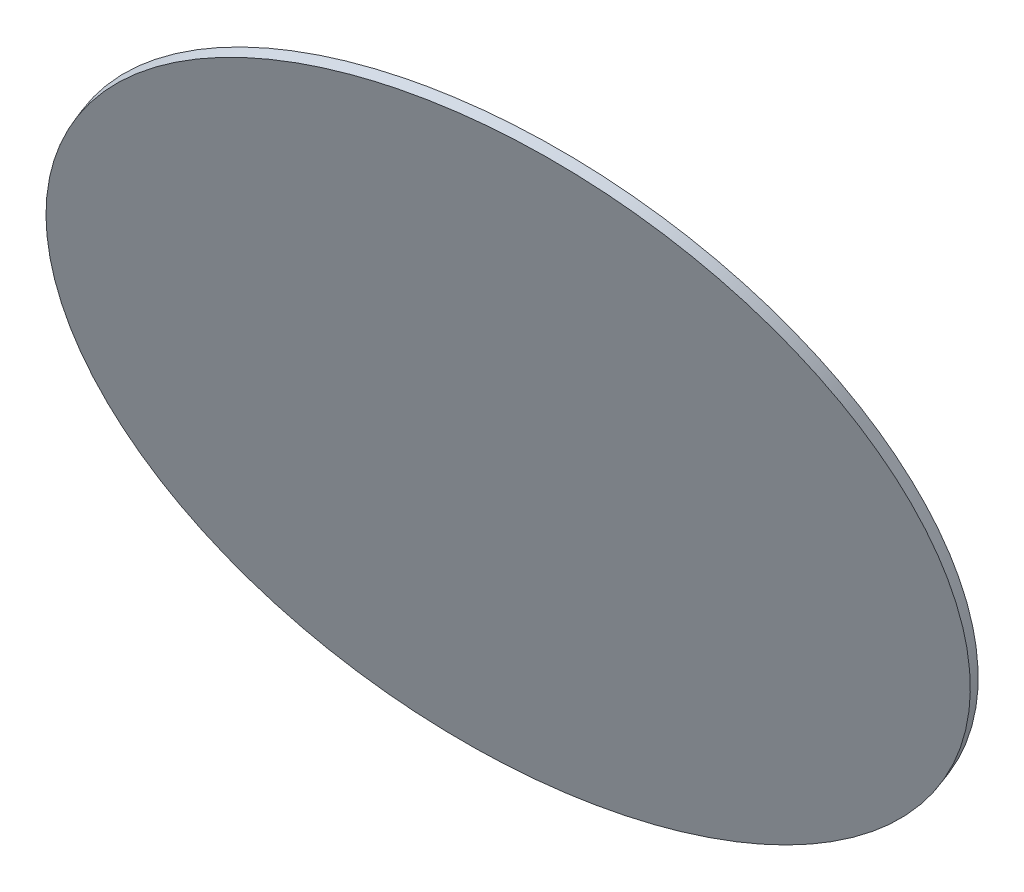
ISO-10303-21;
HEADER;
FILE_DESCRIPTION(('STEP AP214'),'2;1');
FILE_NAME('part.step','',(''),(''),'','','');
FILE_SCHEMA(('AUTOMOTIVE_DESIGN { 1 0 10303 214 1 1 1 1 }'));
ENDSEC;
DATA;
#1=APPLICATION_CONTEXT('core data for automotive mechanical design processes');
#2=APPLICATION_PROTOCOL_DEFINITION('international standard','automotive_design',2000,#1);
#3=PRODUCT_CONTEXT('',#1,'mechanical');
#4=PRODUCT('Part','Part','',(#3));
#5=PRODUCT_RELATED_PRODUCT_CATEGORY('part','',(#4));
#6=PRODUCT_DEFINITION_FORMATION('','',#4);
#7=PRODUCT_DEFINITION_CONTEXT('part definition',#1,'design');
#8=PRODUCT_DEFINITION('design','',#6,#7);
#9=PRODUCT_DEFINITION_SHAPE('','',#8);
#10=(LENGTH_UNIT() NAMED_UNIT(*) SI_UNIT(.MILLI.,.METRE.));
#11=(NAMED_UNIT(*) PLANE_ANGLE_UNIT() SI_UNIT($,.RADIAN.));
#12=(NAMED_UNIT(*) SI_UNIT($,.STERADIAN.) SOLID_ANGLE_UNIT());
#13=UNCERTAINTY_MEASURE_WITH_UNIT(LENGTH_MEASURE(1.E-05),#10,'distance_accuracy_value','');
#14=(GEOMETRIC_REPRESENTATION_CONTEXT(3) GLOBAL_UNCERTAINTY_ASSIGNED_CONTEXT((#13)) GLOBAL_UNIT_ASSIGNED_CONTEXT((#10,
#11,#12)) REPRESENTATION_CONTEXT('',''));
#15=CARTESIAN_POINT('',(0.,0.,0.));
#16=DIRECTION('',(0.,0.,1.));
#17=DIRECTION('',(1.,0.,0.));
#18=AXIS2_PLACEMENT_3D('',#15,#16,#17);
#19=CARTESIAN_POINT('',(-42.9029332590855,402.435326808663,-240.543266880281));
#20=CARTESIAN_POINT('',(-51.1638476256232,401.977621900581,-239.020083496684));
#21=CARTESIAN_POINT('',(-67.6856763586985,400.270607333418,-236.211587877307));
#22=CARTESIAN_POINT('',(-92.2297480946367,395.359930454819,-232.753028913838));
#23=CARTESIAN_POINT('',(-116.298775638929,388.146391051156,-230.081962229423));
#24=CARTESIAN_POINT('',(-139.660961098854,378.699459450207,-228.224111656387));
#25=CARTESIAN_POINT('',(-162.091313857364,367.110114767509,-227.197369311352));
#26=CARTESIAN_POINT('',(-183.373817355716,353.489968727735,-227.011623284376));
#27=CARTESIAN_POINT('',(-203.303509451021,337.970190782778,-227.668662411238));
#28=CARTESIAN_POINT('',(-221.688456313724,320.700244878221,-229.162159045971));
#29=CARTESIAN_POINT('',(-238.351600855302,301.846450033838,-231.477729999556));
#30=CARTESIAN_POINT('',(-253.132467884819,281.590378600513,-234.593075057888));
#31=CARTESIAN_POINT('',(-265.888709572736,260.127107619245,-238.478191745036));
#32=CARTESIAN_POINT('',(-276.497476338328,237.663340122599,-243.095664263481));
#33=CARTESIAN_POINT('',(-284.8565999583,214.415414471514,-248.401023828704));
#34=CARTESIAN_POINT('',(-290.885577502631,190.607220898617,-254.343176927887));
#35=CARTESIAN_POINT('',(-294.526346621793,166.468045322899,-260.864897378374));
#36=CARTESIAN_POINT('',(-295.743844718923,142.230361200969,-267.90337744709));
#37=CARTESIAN_POINT('',(-294.526346621793,118.127590680588,-275.390832723351));
#38=CARTESIAN_POINT('',(-290.885577502631,94.3918566177812,-283.255154919786));
#39=CARTESIAN_POINT('',(-284.8565999583,71.2517471068455,-291.420606314568));
#40=CARTESIAN_POINT('',(-276.497476338328,48.9301140520418,-299.808549147074));
#41=CARTESIAN_POINT('',(-265.888709572736,27.641926981934,-308.338202942513));
#42=CARTESIAN_POINT('',(-253.132467884819,7.59220277531387,-316.927422472051));
#43=CARTESIAN_POINT('',(-238.351600855302,-11.0259687634149,-325.493488856273));
#44=CARTESIAN_POINT('',(-221.688456313724,-28.0332844646061,-333.953906193212));
#45=CARTESIAN_POINT('',(-203.303509451021,-43.265954580913,-342.227196038977));
#46=CARTESIAN_POINT('',(-183.373817355716,-56.577280172091,-350.233682089715));
#47=CARTESIAN_POINT('',(-162.091313857364,-67.8390658959862,-357.896257507965));
#48=CARTESIAN_POINT('',(-139.660961098854,-76.9428545997595,-365.141127503661));
#49=CARTESIAN_POINT('',(-116.298775638929,-83.800971821556,-371.898520018295));
#50=CARTESIAN_POINT('',(-92.2297480946367,-88.3473701435021,-378.103357667984));
#51=CARTESIAN_POINT('',(-67.6856763586986,-90.5382652644427,-383.695884474253));
#52=CARTESIAN_POINT('',(-42.9029332590856,-90.3525576666986,-388.622241346772));
#53=CARTESIAN_POINT('',(-18.1201901594725,-87.7920358159538,-392.834984775836));
#54=CARTESIAN_POINT('',(6.42388157646542,-82.8813589373549,-396.293543739305));
#55=CARTESIAN_POINT('',(30.4929091207575,-75.6678195336914,-398.96461042372));
#56=CARTESIAN_POINT('',(53.8550945806829,-66.2208879327429,-400.822460996757));
#57=CARTESIAN_POINT('',(76.285447339193,-54.6315432500443,-401.849203341791));
#58=CARTESIAN_POINT('',(97.5679508375451,-41.0113972102705,-402.034949368767));
#59=CARTESIAN_POINT('',(117.49764293285,-25.4916192653132,-401.377910241906));
#60=CARTESIAN_POINT('',(135.882589795553,-8.22167336075646,-399.884413607172));
#61=CARTESIAN_POINT('',(152.545734337131,10.6321214836264,-397.568842653588));
#62=CARTESIAN_POINT('',(167.326601366648,30.8881929169509,-394.453497595256));
#63=CARTESIAN_POINT('',(180.082843054565,52.3514638982197,-390.568380908108));
#64=CARTESIAN_POINT('',(190.691609820157,74.8152313948652,-385.950908389663));
#65=CARTESIAN_POINT('',(199.050733440129,98.0631570459506,-380.64554882444));
#66=CARTESIAN_POINT('',(205.07971098446,121.871350618847,-374.703395725257));
#67=CARTESIAN_POINT('',(208.720480103622,146.010526194565,-368.18167527477));
#68=CARTESIAN_POINT('',(209.937978200752,170.248210316495,-361.143195206053));
#69=CARTESIAN_POINT('',(208.720480103622,194.350980836876,-353.655739929793));
#70=CARTESIAN_POINT('',(205.07971098446,218.086714899683,-345.791417733358));
#71=CARTESIAN_POINT('',(199.050733440129,241.226824410619,-337.625966338576));
#72=CARTESIAN_POINT('',(190.691609820157,263.548457465423,-329.23802350607));
#73=CARTESIAN_POINT('',(180.082843054565,284.83664453553,-320.708369710631));
#74=CARTESIAN_POINT('',(167.326601366648,304.88636874215,-312.119150181093));
#75=CARTESIAN_POINT('',(152.545734337131,323.504540280879,-303.553083796871));
#76=CARTESIAN_POINT('',(135.882589795553,340.51185598207,-295.092666459932));
#77=CARTESIAN_POINT('',(117.49764293285,355.744526098377,-286.819376614166));
#78=CARTESIAN_POINT('',(97.5679508375451,369.055851689555,-278.812890563429));
#79=CARTESIAN_POINT('',(76.2854473391931,380.317637413451,-271.150315145178));
#80=CARTESIAN_POINT('',(53.8550945806829,389.421426117224,-263.905445149483));
#81=CARTESIAN_POINT('',(30.4929091207578,396.27954333902,-257.148052634849));
#82=CARTESIAN_POINT('',(6.42388157646569,400.825941660967,-250.94321498516));
#83=CARTESIAN_POINT('',(-18.1201901594725,403.016836781907,-245.35068817889));
#84=CARTESIAN_POINT('',(-34.6420188925479,402.893031716744,-242.066450263878));
#85=CARTESIAN_POINT('',(-42.9029332590855,402.435326808663,-240.543266880281));
#86=B_SPLINE_CURVE_WITH_KNOTS('',3,(#19,#20,#21,#22,#23,#24,#25,#26,#27,#28,#29,#30,#31,#32,#33,
#34,#35,#36,#37,#38,#39,#40,#41,#42,#43,#44,#45,#46,#47,#48,#49,#50,#51,#52,#53,#54,#55,#56,#57,
#58,#59,#60,#61,#62,#63,#64,#65,#66,#67,#68,#69,#70,#71,#72,#73,#74,#75,#76,#77,#78,#79,#80,#81,
#82,#83,#84,#85),.UNSPECIFIED.,.T.,.F.,(4,1,1,1,1,1,1,1,1,1,1,1,1,1,1,1,1,1,1,1,1,1,1,1,1,1,1,1,
1,1,1,1,1,1,1,1,1,1,1,1,1,1,1,1,1,1,1,1,1,1,1,1,1,1,1,1,1,1,1,1,1,1,1,1,4),(0.,0.015625,0.03125,
0.046875,0.0625,0.078125,0.0937499999999999,0.109375,0.125,0.140625,0.15625,0.171875,0.1875,
0.203125,0.21875,0.234375,0.25,0.265625,0.28125,0.296875,0.3125,0.328125,0.34375,0.359375,0.375,
0.390625,0.40625,0.421875,0.4375,0.453125,0.46875,0.484375,0.5,0.515625,0.53125,0.546875,0.5625,
0.578125,0.59375,0.609375,0.625,0.640625,0.65625,0.671875,0.6875,0.703125,0.71875,0.734375,0.75,
0.765625,0.78125,0.796875,0.8125,0.828125,0.84375,0.859375,0.875,0.890625,0.90625,0.921875,
0.9375,0.953125,0.96875,0.984375,1.),.UNSPECIFIED.);
#87=DIRECTION('',(-0.189056978657039,0.282590620546882,-0.9404254356407));
#88=VECTOR('',#87,1.);
#89=SURFACE_OF_LINEAR_EXTRUSION('',#86,#88);
#90=CARTESIAN_POINT('',(-42.9029332590855,402.435326808663,-240.543266880281));
#91=CARTESIAN_POINT('',(-38.7724760758167,402.664179262704,-241.30485857208));
#92=CARTESIAN_POINT('',(-34.6420188925479,402.794081122869,-242.096184157355));
#93=CARTESIAN_POINT('',(-26.3910491661633,402.855909136047,-243.736326301957));
#94=CARTESIAN_POINT('',(-22.2705366230475,402.787835289059,-244.585142861283));
#95=CARTESIAN_POINT('',(-14.0494008171223,402.453637368527,-246.338290141081));
#96=CARTESIAN_POINT('',(-9.94877755431285,402.187513294982,-247.242620861553));
#97=CARTESIAN_POINT('',(-1.77726917683227,401.458094067905,-249.104552334879));
#98=CARTESIAN_POINT('',(2.29361593783883,400.994798914373,-250.062153087733));
#99=CARTESIAN_POINT('',(10.3957991512105,399.871916673892,-252.028380497059));
#100=CARTESIAN_POINT('',(14.4270972499111,399.212329586943,-253.037007153532));
#101=CARTESIAN_POINT('',(22.4404481858117,397.698687825509,-255.102796537658));
#102=CARTESIAN_POINT('',(26.4225010230118,396.844633151024,-256.159959265313));
#103=CARTESIAN_POINT('',(34.3277031903813,394.9438805604,-258.320330959367));
#104=CARTESIAN_POINT('',(38.2508525205508,393.897182644261,-259.423539925766));
#105=CARTESIAN_POINT('',(46.0288730648155,391.613895546074,-261.673292539649));
#106=CARTESIAN_POINT('',(49.8837442789107,390.377306364025,-262.819836187132));
#107=CARTESIAN_POINT('',(57.5158339819833,387.716988709764,-265.15354660552));
#108=CARTESIAN_POINT('',(61.2930524709606,386.29326023755,-266.340713376425));
#109=CARTESIAN_POINT('',(68.7608360338497,383.262317105537,-268.752762872553));
#110=CARTESIAN_POINT('',(72.4514011077615,381.655102445736,-269.977645597775));
#111=CARTESIAN_POINT('',(79.7368771505719,378.260840041125,-272.462219833433));
#112=CARTESIAN_POINT('',(83.3317881194705,376.473792296314,-273.721911343868));
#113=CARTESIAN_POINT('',(90.4174158629675,372.724382769717,-276.273028367032));
#114=CARTESIAN_POINT('',(93.9081326375659,370.762020987931,-277.564453879761));
#115=CARTESIAN_POINT('',(100.776831903175,366.666502435419,-280.175964124592));
#116=CARTESIAN_POINT('',(104.154814394187,364.533345664693,-281.496048856695));
#117=CARTESIAN_POINT('',(110.790047849723,360.10157860689,-284.16166475538));
#118=CARTESIAN_POINT('',(114.047298814249,357.802968319813,-285.507195921962));
#119=CARTESIAN_POINT('',(120.433071973917,353.045635701899,-288.220491904713));
#120=CARTESIAN_POINT('',(123.56159416906,350.586913371061,-289.588256720881));
#121=CARTESIAN_POINT('',(129.682532411272,345.515469121469,-292.342700156809));
#122=CARTESIAN_POINT('',(132.674948458342,342.902747202715,-293.729378776569));
#123=CARTESIAN_POINT('',(138.516297025722,337.529416233132,-296.518329973686));
#124=CARTESIAN_POINT('',(141.365229546032,334.768807182303,-297.920602551044));
#125=CARTESIAN_POINT('',(146.912924593603,329.106526521379,-300.737346728194));
#126=CARTESIAN_POINT('',(149.611687120863,326.204854911283,-302.151818327988));
#127=CARTESIAN_POINT('',(154.852355716046,320.26727370463,-304.989565614848));
#128=CARTESIAN_POINT('',(157.394261783968,317.231364108072,-306.412841301915));
#129=CARTESIAN_POINT('',(162.315286300909,311.032777893898,-309.264759434074));
#130=CARTESIAN_POINT('',(164.694404749928,307.870101276281,-310.693401879166));
#131=CARTESIAN_POINT('',(169.283922869501,301.42545198539,-313.552616198126));
#132=CARTESIAN_POINT('',(171.494322540054,298.143479312115,-314.983188071994));
#133=CARTESIAN_POINT('',(175.741284370162,291.468283318425,-317.842814628531));
#134=CARTESIAN_POINT('',(177.777846529718,288.07505999801,-319.2718693112));
#135=CARTESIAN_POINT('',(181.672014605303,281.185408118555,-322.125014865362));
#136=CARTESIAN_POINT('',(183.529620521332,277.688979559516,-323.549105736856));
#137=CARTESIAN_POINT('',(187.061619100559,270.601459572763,-326.388900950801));
#138=CARTESIAN_POINT('',(188.736011763757,267.010368145049,-327.804605293252));
#139=CARTESIAN_POINT('',(191.897326828017,259.742064790898,-330.624204731243));
#140=CARTESIAN_POINT('',(193.38424922908,256.064852864459,-332.028099826783));
#141=CARTESIAN_POINT('',(196.16726948032,248.633265576548,-334.820714917835));
#142=CARTESIAN_POINT('',(197.463367330497,244.878890215075,-336.209434913348));
#143=CARTESIAN_POINT('',(199.861384191214,237.301933120785,-338.968333951229));
#144=CARTESIAN_POINT('',(200.963303201754,233.479351387968,-340.338512993598));
#145=CARTESIAN_POINT('',(202.970543118634,225.775267047001,-343.057053551833));
#146=CARTESIAN_POINT('',(203.875864024974,221.89376443885,-344.405415067699));
#147=CARTESIAN_POINT('',(205.48748846889,214.081123843226,-347.077043999568));
#148=CARTESIAN_POINT('',(206.193792006465,210.149985855753,-348.400311415572));
#149=CARTESIAN_POINT('',(207.405920771317,202.247599005413,-351.018596409307));
#150=CARTESIAN_POINT('',(207.911745998592,198.276350142547,-352.313613987039));
#151=CARTESIAN_POINT('',(208.721457201308,190.303266045348,-354.872243565822));
#152=CARTESIAN_POINT('',(209.025343176747,186.301430811017,-356.135855566872));
#153=CARTESIAN_POINT('',(209.430687326948,178.276845756558,-358.628669480319));
#154=CARTESIAN_POINT('',(209.532145501709,174.25409593643,-359.857871392714));
#155=CARTESIAN_POINT('',(209.532145501709,166.197353496045,-362.278860616877));
#156=CARTESIAN_POINT('',(209.430687326948,162.163360875788,-363.470647928645));
#157=CARTESIAN_POINT('',(209.025343176748,154.093858757968,-365.813983601105));
#158=CARTESIAN_POINT('',(208.721457201308,150.058349260405,-366.965531961798));
#159=CARTESIAN_POINT('',(207.911745998592,141.995539310797,-369.225565381665));
#160=CARTESIAN_POINT('',(207.405920771317,137.968238858752,-370.334050440839));
#161=CARTESIAN_POINT('',(206.193792006465,129.931533394204,-372.50534026879));
#162=CARTESIAN_POINT('',(205.487488468889,125.922128381702,-373.568145037567));
#163=CARTESIAN_POINT('',(203.875864024974,117.930900190267,-375.645457295845));
#164=CARTESIAN_POINT('',(202.970543118634,113.949077011333,-376.659964785347));
#165=CARTESIAN_POINT('',(200.963303201754,106.022566066992,-378.638298060797));
#166=CARTESIAN_POINT('',(199.861384191214,102.077878301585,-379.602123846746));
#167=CARTESIAN_POINT('',(197.463367330497,94.2351917642545,-381.476709290813));
#168=CARTESIAN_POINT('',(196.16726948032,90.3371929923314,-382.387468948932));
#169=CARTESIAN_POINT('',(193.38424922908,82.5972132016625,-384.153793240972));
#170=CARTESIAN_POINT('',(191.897326828018,78.7552321829166,-385.009357874894));
#171=CARTESIAN_POINT('',(188.736011763757,71.1366166582948,-386.663163222172));
#172=CARTESIAN_POINT('',(187.061619100559,67.3599821524188,-387.461403935528));
#173=CARTESIAN_POINT('',(183.529620521332,59.8810737519094,-388.998708575655));
#174=CARTESIAN_POINT('',(181.672014605303,56.1787998572758,-389.737772502425));
#175=CARTESIAN_POINT('',(177.777846529719,48.8576267776234,-391.154870703358));
#176=CARTESIAN_POINT('',(175.741284370163,45.2387275926045,-391.83290497752));
#177=CARTESIAN_POINT('',(171.494322540054,38.0929165585386,-393.126384881672));
#178=CARTESIAN_POINT('',(169.283922869501,34.5660047094914,-393.741830511663));
#179=CARTESIAN_POINT('',(164.694404749929,27.6127809737258,-394.90857413591));
#180=CARTESIAN_POINT('',(162.315286300909,24.1864690870074,-395.459872130166));
#181=CARTESIAN_POINT('',(157.394261783968,17.4425734859408,-396.497070379779));
#182=CARTESIAN_POINT('',(154.852355716046,14.1249897715926,-396.982970635137));
#183=CARTESIAN_POINT('',(149.611687120863,7.60667872530802,-397.88812330379));
#184=CARTESIAN_POINT('',(146.912924593603,4.40595139337165,-398.307375717085));
#185=CARTESIAN_POINT('',(141.365229546033,-1.8710813734691,-399.078303526026));
#186=CARTESIAN_POINT('',(138.516297025723,-4.94738680837348,-399.429978921671));
#187=CARTESIAN_POINT('',(132.674948458343,-10.9680102665301,-400.064823519724));
#188=CARTESIAN_POINT('',(129.682532411272,-13.9123282897823,-400.347992722131));
#189=CARTESIAN_POINT('',(123.56159416906,-19.6620469654773,-400.845225634167));
#190=CARTESIAN_POINT('',(120.433071973918,-22.4674476179201,-401.059289343794));
#191=CARTESIAN_POINT('',(114.04729881425,-27.9324015928391,-401.417711970727));
#192=CARTESIAN_POINT('',(110.790047849724,-30.5919549153153,-401.562070888032));
#193=CARTESIAN_POINT('',(104.154814394187,-35.7589865659018,-401.780820278403));
#194=CARTESIAN_POINT('',(100.776831903176,-38.266464894012,-401.855210751471));
#195=CARTESIAN_POINT('',(93.9081326375663,-43.1231188914672,-401.933759601452));
#196=CARTESIAN_POINT('',(90.4174158629679,-45.4722945608122,-401.937917978365));
#197=CARTESIAN_POINT('',(83.3317881194709,-50.006877846908,-401.876077170864));
#198=CARTESIAN_POINT('',(79.7368771505723,-52.1922854636588,-401.810077986449));
#199=CARTESIAN_POINT('',(72.4514011077619,-56.3938672507376,-401.607996591114));
#200=CARTESIAN_POINT('',(68.7608360338502,-58.4100414210655,-401.471914380194));
#201=CARTESIAN_POINT('',(61.2930524709611,-62.2685058267702,-401.130078935602));
#202=CARTESIAN_POINT('',(57.5158339819838,-64.1107960621471,-400.924325701929));
#203=CARTESIAN_POINT('',(49.8837442789112,-67.6168421094216,-400.443560215584));
#204=CARTESIAN_POINT('',(46.0288730648159,-69.2805979213193,-400.168547962911));
#205=CARTESIAN_POINT('',(38.2508525205511,-72.4257843251549,-399.550009943425));
#206=CARTESIAN_POINT('',(34.3277031903816,-73.9072149170928,-399.206484176612));
#207=CARTESIAN_POINT('',(26.4225010230121,-76.6839600845281,-398.451664633703));
#208=CARTESIAN_POINT('',(22.440448185812,-77.9792746600256,-398.040370857608));
#209=CARTESIAN_POINT('',(14.4270972499113,-80.3808931975893,-397.151087122483));
#210=CARTESIAN_POINT('',(10.3957991512108,-81.4871971596555,-396.673097163454));
#211=CARTESIAN_POINT('',(2.2936159378391,-83.5078998733659,-395.651492888806));
#212=CARTESIAN_POINT('',(-1.77726917683198,-84.4222986250101,-395.107878573189));
#213=CARTESIAN_POINT('',(-9.9487775543125,-86.0572203969268,-393.956413410926));
#214=CARTESIAN_POINT('',(-14.049400817122,-86.7777434171994,-393.348562564282));
#215=CARTESIAN_POINT('',(-22.2705366230471,-88.0229432054233,-392.070012165526));
#216=CARTESIAN_POINT('',(-26.3910491661628,-88.5476199733747,-391.399312613415));
#217=CARTESIAN_POINT('',(-34.6420188925474,-89.4000997892419,-389.996755262983));
#218=CARTESIAN_POINT('',(-38.7724760758162,-89.7279028371577,-389.264897464661));
#219=CARTESIAN_POINT('',(-47.0333904423539,-90.1856077452392,-387.741714081064));
#220=CARTESIAN_POINT('',(-51.1638476256227,-90.3155096054049,-386.950388495788));
#221=CARTESIAN_POINT('',(-59.4148173520073,-90.3773376185828,-385.310246351187));
#222=CARTESIAN_POINT('',(-63.535329895123,-90.309263771595,-384.461429791861));
#223=CARTESIAN_POINT('',(-71.7564657010482,-89.9750658510622,-382.708282512063));
#224=CARTESIAN_POINT('',(-75.8570889638577,-89.7089417775173,-381.803951791591));
#225=CARTESIAN_POINT('',(-84.0285973413382,-88.9795225504404,-379.942020318265));
#226=CARTESIAN_POINT('',(-88.0994824560094,-88.5162273969084,-378.984419565411));
#227=CARTESIAN_POINT('',(-96.201665669381,-87.3933451564273,-377.018192156085));
#228=CARTESIAN_POINT('',(-100.232963768082,-86.7337580694782,-376.009565499612));
#229=CARTESIAN_POINT('',(-108.246314703982,-85.2201163080444,-373.943776115486));
#230=CARTESIAN_POINT('',(-112.228367541182,-84.3660616335596,-372.886613387831));
#231=CARTESIAN_POINT('',(-120.133569708552,-82.4653090429358,-370.726241693778));
#232=CARTESIAN_POINT('',(-124.056719038721,-81.4186111267968,-369.623032727378));
#233=CARTESIAN_POINT('',(-131.834739582986,-79.1353240286094,-367.373280113495));
#234=CARTESIAN_POINT('',(-135.689610797081,-77.898734846561,-366.226736466012));
#235=CARTESIAN_POINT('',(-143.321700500154,-75.2384171922994,-363.893026047624));
#236=CARTESIAN_POINT('',(-147.098918989131,-73.8146887200862,-362.705859276719));
#237=CARTESIAN_POINT('',(-154.56670255202,-70.7837455880724,-360.293809780591));
#238=CARTESIAN_POINT('',(-158.257267625932,-69.1765309282718,-359.068927055369));
#239=CARTESIAN_POINT('',(-165.542743668743,-65.7822685236604,-356.584352819711));
#240=CARTESIAN_POINT('',(-169.137654637641,-63.9952207788496,-355.324661309276));
#241=CARTESIAN_POINT('',(-176.223282381138,-60.2458112522529,-352.773544286112));
#242=CARTESIAN_POINT('',(-179.713999155737,-58.2834494704669,-351.482118773383));
#243=CARTESIAN_POINT('',(-186.582698421346,-54.1879309179547,-348.870608528552));
#244=CARTESIAN_POINT('',(-189.960680912357,-52.0547741472285,-347.550523796449));
#245=CARTESIAN_POINT('',(-196.595914367894,-47.6230070894256,-344.884907897764));
#246=CARTESIAN_POINT('',(-199.85316533242,-45.3243968023489,-343.539376731182));
#247=CARTESIAN_POINT('',(-206.238938492088,-40.5670641844347,-340.826080748431));
#248=CARTESIAN_POINT('',(-209.36746068723,-38.1083418535973,-339.458315932263));
#249=CARTESIAN_POINT('',(-215.488398929443,-33.0368976040052,-336.703872496335));
#250=CARTESIAN_POINT('',(-218.480814976513,-30.4241756852505,-335.317193876575));
#251=CARTESIAN_POINT('',(-224.322163543893,-25.0508447156675,-332.528242679458));
#252=CARTESIAN_POINT('',(-227.171096064203,-22.2902356648392,-331.1259701021));
#253=CARTESIAN_POINT('',(-232.718791111774,-16.6279550039149,-328.309225924949));
#254=CARTESIAN_POINT('',(-235.417553639034,-13.726283393819,-326.894754325156));
#255=CARTESIAN_POINT('',(-240.658222234216,-7.78870218716564,-324.057007038296));
#256=CARTESIAN_POINT('',(-243.200128302138,-4.75279259060825,-322.633731351229));
#257=CARTESIAN_POINT('',(-248.12115281908,1.44579362356607,-319.78181321907));
#258=CARTESIAN_POINT('',(-250.500271268099,4.60847024118301,-318.353170773978));
#259=CARTESIAN_POINT('',(-255.089789387672,11.0531195320745,-315.493956455018));
#260=CARTESIAN_POINT('',(-257.300189058224,14.335092205349,-314.06338458115));
#261=CARTESIAN_POINT('',(-261.547150888333,21.0102881990389,-311.203758024613));
#262=CARTESIAN_POINT('',(-263.583713047889,24.4035115194543,-309.774703341944));
#263=CARTESIAN_POINT('',(-267.477881123474,31.2931633989089,-306.921557787782));
#264=CARTESIAN_POINT('',(-269.335487039503,34.7895919579483,-305.497466916288));
#265=CARTESIAN_POINT('',(-272.86748561873,41.8771119447012,-302.657671702343));
#266=CARTESIAN_POINT('',(-274.541878281928,45.4682033724148,-301.241967359892));
#267=CARTESIAN_POINT('',(-277.703193346189,52.7365067265667,-298.422367921901));
#268=CARTESIAN_POINT('',(-279.190115747251,56.413718653005,-297.018472826361));
#269=CARTESIAN_POINT('',(-281.973135998491,63.8453059409161,-294.225857735308));
#270=CARTESIAN_POINT('',(-283.269233848668,67.5996813023889,-292.837137739796));
#271=CARTESIAN_POINT('',(-285.667250709385,75.1766383966788,-290.078238701914));
#272=CARTESIAN_POINT('',(-286.769169719925,78.9992201294959,-288.708059659546));
#273=CARTESIAN_POINT('',(-288.776409636805,86.7033044704636,-285.989519101311));
#274=CARTESIAN_POINT('',(-289.681730543145,90.5848070786142,-284.641157585445));
#275=CARTESIAN_POINT('',(-291.293354987061,98.397447674238,-281.969528653576));
#276=CARTESIAN_POINT('',(-291.999658524636,102.328585661711,-280.646261237572));
#277=CARTESIAN_POINT('',(-293.211787289488,110.230972512051,-278.027976243837));
#278=CARTESIAN_POINT('',(-293.717612516764,114.202221374918,-276.732958666105));
#279=CARTESIAN_POINT('',(-294.527323719479,122.175305472116,-274.174329087322));
#280=CARTESIAN_POINT('',(-294.831209694919,126.177140706447,-272.910717086272));
#281=CARTESIAN_POINT('',(-295.236553845119,134.201725760907,-270.417903172825));
#282=CARTESIAN_POINT('',(-295.33801201988,138.224475581035,-269.188701260429));
#283=CARTESIAN_POINT('',(-295.33801201988,146.28121802142,-266.767712036266));
#284=CARTESIAN_POINT('',(-295.236553845119,150.315210641677,-265.575924724499));
#285=CARTESIAN_POINT('',(-294.831209694919,158.384712759497,-263.232589052039));
#286=CARTESIAN_POINT('',(-294.527323719479,162.42022225706,-262.081040691346));
#287=CARTESIAN_POINT('',(-293.717612516764,170.483032206668,-259.821007271478));
#288=CARTESIAN_POINT('',(-293.211787289488,174.510332658713,-258.712522212305));
#289=CARTESIAN_POINT('',(-291.999658524636,182.54703812326,-256.541232384354));
#290=CARTESIAN_POINT('',(-291.293354987061,186.556443135762,-255.478427615577));
#291=CARTESIAN_POINT('',(-289.681730543145,194.547671327198,-253.401115357299));
#292=CARTESIAN_POINT('',(-288.776409636805,198.529494506131,-252.386607867797));
#293=CARTESIAN_POINT('',(-286.769169719926,206.456005450472,-250.408274592347));
#294=CARTESIAN_POINT('',(-285.667250709385,210.40069321588,-249.444448806398));
#295=CARTESIAN_POINT('',(-283.269233848668,218.24337975321,-247.56986336233));
#296=CARTESIAN_POINT('',(-281.973135998491,222.141378525133,-246.659103704212));
#297=CARTESIAN_POINT('',(-279.190115747251,229.881358315802,-244.892779412171));
#298=CARTESIAN_POINT('',(-277.703193346189,233.723339334548,-244.03721477825));
#299=CARTESIAN_POINT('',(-274.541878281928,241.34195485917,-242.383409430972));
#300=CARTESIAN_POINT('',(-272.86748561873,245.118589365046,-241.585168717615));
#301=CARTESIAN_POINT('',(-269.335487039503,252.597497765555,-240.047864077489));
#302=CARTESIAN_POINT('',(-267.477881123474,256.299771660189,-239.308800150718));
#303=CARTESIAN_POINT('',(-263.58371304789,263.620944739841,-237.891701949786));
#304=CARTESIAN_POINT('',(-261.547150888334,267.23984392486,-237.213667675624));
#305=CARTESIAN_POINT('',(-257.300189058225,274.385654958926,-235.920187771471));
#306=CARTESIAN_POINT('',(-255.089789387672,277.912566807973,-235.304742141481));
#307=CARTESIAN_POINT('',(-250.5002712681,284.865790543739,-234.137998517234));
#308=CARTESIAN_POINT('',(-248.12115281908,288.292102430457,-233.586700522978));
#309=CARTESIAN_POINT('',(-243.200128302139,295.035998031524,-232.549502273364));
#310=CARTESIAN_POINT('',(-240.658222234217,298.353581745872,-232.063602018007));
#311=CARTESIAN_POINT('',(-235.417553639034,304.871892792157,-231.158449349354));
#312=CARTESIAN_POINT('',(-232.718791111774,308.072620124093,-230.739196936059));
#313=CARTESIAN_POINT('',(-227.171096064204,314.349652890934,-229.968269127118));
#314=CARTESIAN_POINT('',(-224.322163543894,317.425958325838,-229.616593731473));
#315=CARTESIAN_POINT('',(-218.480814976514,323.446581783995,-228.98174913342));
#316=CARTESIAN_POINT('',(-215.488398929443,326.390899807247,-228.698579931012));
#317=CARTESIAN_POINT('',(-209.367460687231,332.140618482942,-228.201347018977));
#318=CARTESIAN_POINT('',(-206.238938492088,334.946019135385,-227.98728330935));
#319=CARTESIAN_POINT('',(-199.85316533242,340.410973110304,-227.628860682417));
#320=CARTESIAN_POINT('',(-196.595914367895,343.07052643278,-227.484501765112));
#321=CARTESIAN_POINT('',(-189.960680912358,348.237558083366,-227.26575237474));
#322=CARTESIAN_POINT('',(-186.582698421347,350.745036411477,-227.191361901673));
#323=CARTESIAN_POINT('',(-179.713999155737,355.601690408932,-227.112813051692));
#324=CARTESIAN_POINT('',(-176.223282381139,357.950866078277,-227.108654674778));
#325=CARTESIAN_POINT('',(-169.137654637642,362.485449364373,-227.17049548228));
#326=CARTESIAN_POINT('',(-165.542743668743,364.670856981123,-227.236494666695));
#327=CARTESIAN_POINT('',(-158.257267625933,368.872438768202,-227.43857606203));
#328=CARTESIAN_POINT('',(-154.566702552021,370.88861293853,-227.57465827295));
#329=CARTESIAN_POINT('',(-147.098918989132,374.747077344235,-227.916493717542));
#330=CARTESIAN_POINT('',(-143.321700500154,376.589367579612,-228.122246951215));
#331=CARTESIAN_POINT('',(-135.689610797082,380.095413626886,-228.60301243756));
#332=CARTESIAN_POINT('',(-131.834739582987,381.759169438784,-228.878024690233));
#333=CARTESIAN_POINT('',(-124.056719038722,384.904355842619,-229.496562709719));
#334=CARTESIAN_POINT('',(-120.133569708552,386.385786434557,-229.840088476532));
#335=CARTESIAN_POINT('',(-112.228367541183,389.162531601993,-230.594908019441));
#336=CARTESIAN_POINT('',(-108.246314703983,390.45784617749,-231.006201795536));
#337=CARTESIAN_POINT('',(-100.232963768082,392.859464715054,-231.895485530661));
#338=CARTESIAN_POINT('',(-96.2016656693815,393.96576867712,-232.37347548969));
#339=CARTESIAN_POINT('',(-88.0994824560098,395.98647139083,-233.395079764338));
#340=CARTESIAN_POINT('',(-84.0285973413387,396.900870142474,-233.938694079955));
#341=CARTESIAN_POINT('',(-75.8570889638581,398.535791914391,-235.090159242218));
#342=CARTESIAN_POINT('',(-71.7564657010486,399.256314934664,-235.698010088862));
#343=CARTESIAN_POINT('',(-63.5353298951234,400.501514722888,-236.976560487618));
#344=CARTESIAN_POINT('',(-59.4148173520077,401.026191490839,-237.647260039729));
#345=CARTESIAN_POINT('',(-51.1638476256232,401.878671306706,-239.049817390161));
#346=CARTESIAN_POINT('',(-47.0333904423544,402.206474354622,-239.781675188482));
#347=CARTESIAN_POINT('',(-42.9029332590855,402.435326808663,-240.543266880281));
#348=B_SPLINE_CURVE_WITH_KNOTS('',3,(#90,#91,#92,#93,#94,#95,#96,#97,#98,#99,#100,#101,#102,
#103,#104,#105,#106,#107,#108,#109,#110,#111,#112,#113,#114,#115,#116,#117,#118,#119,#120,#121,
#122,#123,#124,#125,#126,#127,#128,#129,#130,#131,#132,#133,#134,#135,#136,#137,#138,#139,#140,
#141,#142,#143,#144,#145,#146,#147,#148,#149,#150,#151,#152,#153,#154,#155,#156,#157,#158,#159,
#160,#161,#162,#163,#164,#165,#166,#167,#168,#169,#170,#171,#172,#173,#174,#175,#176,#177,#178,
#179,#180,#181,#182,#183,#184,#185,#186,#187,#188,#189,#190,#191,#192,#193,#194,#195,#196,#197,
#198,#199,#200,#201,#202,#203,#204,#205,#206,#207,#208,#209,#210,#211,#212,#213,#214,#215,#216,
#217,#218,#219,#220,#221,#222,#223,#224,#225,#226,#227,#228,#229,#230,#231,#232,#233,#234,#235,
#236,#237,#238,#239,#240,#241,#242,#243,#244,#245,#246,#247,#248,#249,#250,#251,#252,#253,#254,
#255,#256,#257,#258,#259,#260,#261,#262,#263,#264,#265,#266,#267,#268,#269,#270,#271,#272,#273,
#274,#275,#276,#277,#278,#279,#280,#281,#282,#283,#284,#285,#286,#287,#288,#289,#290,#291,#292,
#293,#294,#295,#296,#297,#298,#299,#300,#301,#302,#303,#304,#305,#306,#307,#308,#309,#310,#311,
#312,#313,#314,#315,#316,#317,#318,#319,#320,#321,#322,#323,#324,#325,#326,#327,#328,#329,#330,
#331,#332,#333,#334,#335,#336,#337,#338,#339,#340,#341,#342,#343,#344,#345,#346,#347),
.UNSPECIFIED.,.F.,.F.,(4,2,2,2,2,2,2,2,2,2,2,2,2,2,2,2,2,2,2,2,2,2,2,2,2,2,2,2,2,2,2,2,2,2,2,2,
2,2,2,2,2,2,2,2,2,2,2,2,2,2,2,2,2,2,2,2,2,2,2,2,2,2,2,2,2,2,2,2,2,2,2,2,2,2,2,2,2,2,2,2,2,2,2,2,
2,2,2,2,2,2,2,2,2,2,2,2,2,2,2,2,2,2,2,2,2,2,2,2,2,2,2,2,2,2,2,2,2,2,2,2,2,2,2,2,2,2,2,2,4),(0.,
12.6176781138511,25.2353562277023,37.8530343415533,50.4707124554044,63.0883905692554,
75.7060686831064,88.3237467969574,100.941424910808,113.55910302466,126.176781138511,
138.794459252362,151.412137366213,164.029815480064,176.647493593915,189.265171707766,
201.882849821617,214.500527935468,227.118206049319,239.73588416317,252.353562277021,
264.971240390872,277.588918504723,290.206596618574,302.824274732425,315.441952846276,
328.059630960127,340.677309073978,353.294987187829,365.91266530168,378.530343415531,
391.148021529383,403.765699643234,416.383377757085,429.001055870936,441.618733984787,
454.236412098638,466.854090212489,479.47176832634,492.089446440191,504.707124554042,
517.324802667893,529.942480781744,542.560158895595,555.177837009446,567.795515123297,
580.413193237148,593.030871350999,605.64854946485,618.266227578701,630.883905692552,
643.501583806403,656.119261920254,668.736940034105,681.354618147957,693.972296261808,
706.589974375659,719.20765248951,731.825330603361,744.443008717212,757.060686831063,
769.678364944914,782.296043058765,794.913721172616,807.531399286467,820.149077400318,
832.766755514169,845.38443362802,858.002111741871,870.619789855722,883.237467969573,
895.855146083425,908.472824197275,921.090502311127,933.708180424978,946.325858538829,
958.94353665268,971.561214766531,984.178892880382,996.796570994233,1009.41424910808,
1022.03192722194,1034.64960533579,1047.26728344964,1059.88496156349,1072.50263967734,
1085.12031779119,1097.73799590504,1110.35567401889,1122.97335213274,1135.59103024659,
1148.20870836045,1160.8263864743,1173.44406458815,1186.061742702,1198.67942081585,
1211.2970989297,1223.91477704355,1236.5324551574,1249.15013327125,1261.76781138511,
1274.38548949896,1287.00316761281,1299.62084572666,1312.23852384051,1324.85620195436,
1337.47388006821,1350.09155818206,1362.70923629591,1375.32691440977,1387.94459252362,
1400.56227063747,1413.17994875132,1425.79762686517,1438.41530497902,1451.03298309287,
1463.65066120672,1476.26833932057,1488.88601743443,1501.50369554828,1514.12137366213,
1526.73905177598,1539.35672988983,1551.97440800368,1564.59208611753,1577.20976423138,
1589.82744234523,1602.44512045908,1615.06279857294),.UNSPECIFIED.);
#349=CARTESIAN_POINT('',(-42.9029332590855,402.435326808663,-240.543266880281));
#350=VERTEX_POINT('',#349);
#351=EDGE_CURVE('E9',#350,#350,#348,.F.);
#352=ORIENTED_EDGE('',*,*,#351,.F.);
#353=EDGE_LOOP('',(#352));
#354=FACE_BOUND('',#353,.T.);
#355=CARTESIAN_POINT('',(-44.2240048033618,404.409982439657,-247.114668218458));
#356=CARTESIAN_POINT('',(-52.4849191698995,403.952277531575,-245.591484834861));
#357=CARTESIAN_POINT('',(-69.0067479029748,402.245262964412,-242.782989215484));
#358=CARTESIAN_POINT('',(-93.550819638913,397.334586085813,-239.324430252015));
#359=CARTESIAN_POINT('',(-117.619847183205,390.12104668215,-236.6533635676));
#360=CARTESIAN_POINT('',(-140.98203264313,380.674115081201,-234.795512994564));
#361=CARTESIAN_POINT('',(-163.41238540164,369.084770398503,-233.768770649529));
#362=CARTESIAN_POINT('',(-184.694888899992,355.464624358729,-233.583024622553));
#363=CARTESIAN_POINT('',(-204.624580995298,339.944846413772,-234.240063749415));
#364=CARTESIAN_POINT('',(-223.009527858001,322.674900509215,-235.733560384148));
#365=CARTESIAN_POINT('',(-239.672672399579,303.821105664832,-238.049131337733));
#366=CARTESIAN_POINT('',(-254.453539429095,283.565034231508,-241.164476396065));
#367=CARTESIAN_POINT('',(-267.209781117012,262.101763250239,-245.049593083213));
#368=CARTESIAN_POINT('',(-277.818547882604,239.637995753593,-249.667065601658));
#369=CARTESIAN_POINT('',(-286.177671502577,216.390070102508,-254.972425166881));
#370=CARTESIAN_POINT('',(-292.206649046907,192.581876529611,-260.914578266064));
#371=CARTESIAN_POINT('',(-295.847418166069,168.442700953893,-267.436298716551));
#372=CARTESIAN_POINT('',(-297.0649162632,144.205016831964,-274.474778785267));
#373=CARTESIAN_POINT('',(-295.84741816607,120.102246311582,-281.962234061528));
#374=CARTESIAN_POINT('',(-292.206649046907,96.3665122487753,-289.826556257963));
#375=CARTESIAN_POINT('',(-286.177671502577,73.2264027378396,-297.992007652744));
#376=CARTESIAN_POINT('',(-277.818547882605,50.904769683036,-306.379950485251));
#377=CARTESIAN_POINT('',(-267.209781117012,29.6165826129281,-314.90960428069));
#378=CARTESIAN_POINT('',(-254.453539429095,9.56685840630803,-323.498823810228));
#379=CARTESIAN_POINT('',(-239.672672399579,-9.05131313242074,-332.06489019445));
#380=CARTESIAN_POINT('',(-223.009527858001,-26.0586288336119,-340.525307531389));
#381=CARTESIAN_POINT('',(-204.624580995298,-41.2912989499188,-348.798597377154));
#382=CARTESIAN_POINT('',(-184.694888899993,-54.6026245410969,-356.805083427892));
#383=CARTESIAN_POINT('',(-163.41238540164,-65.864410264992,-364.467658846142));
#384=CARTESIAN_POINT('',(-140.98203264313,-74.9681989687653,-371.712528841838));
#385=CARTESIAN_POINT('',(-117.619847183205,-81.8263161905618,-378.469921356472));
#386=CARTESIAN_POINT('',(-93.550819638913,-86.3727145125079,-384.674759006161));
#387=CARTESIAN_POINT('',(-69.0067479029749,-88.5636096334485,-390.26728581243));
#388=CARTESIAN_POINT('',(-44.2240048033619,-88.3779020357045,-395.193642684949));
#389=CARTESIAN_POINT('',(-19.4412617037488,-85.8173801849596,-399.406386114013));
#390=CARTESIAN_POINT('',(5.10281003218913,-80.9067033063608,-402.864945077482));
#391=CARTESIAN_POINT('',(29.1718375764812,-73.6931639026973,-405.536011761897));
#392=CARTESIAN_POINT('',(52.5340230364066,-64.2462323017487,-407.393862334934));
#393=CARTESIAN_POINT('',(74.9643757949167,-52.6568876190501,-408.420604679968));
#394=CARTESIAN_POINT('',(96.2468792932688,-39.0367415792764,-408.606350706944));
#395=CARTESIAN_POINT('',(116.176571388574,-23.516963634319,-407.949311580083));
#396=CARTESIAN_POINT('',(134.561518251277,-6.2470177297623,-406.455814945349));
#397=CARTESIAN_POINT('',(151.224662792855,12.6067771146205,-404.140243991765));
#398=CARTESIAN_POINT('',(166.005529822372,32.862848547945,-401.024898933433));
#399=CARTESIAN_POINT('',(178.761771510289,54.3261195292139,-397.139782246285));
#400=CARTESIAN_POINT('',(189.370538275881,76.7898870258594,-392.522309727839));
#401=CARTESIAN_POINT('',(197.729661895853,100.037812676945,-387.216950162616));
#402=CARTESIAN_POINT('',(203.758639440183,123.846006249841,-381.274797063434));
#403=CARTESIAN_POINT('',(207.399408559346,147.985181825559,-374.753076612947));
#404=CARTESIAN_POINT('',(208.616906656476,172.222865947489,-367.71459654423));
#405=CARTESIAN_POINT('',(207.399408559346,196.32563646787,-360.22714126797));
#406=CARTESIAN_POINT('',(203.758639440184,220.061370530677,-352.362819071535));
#407=CARTESIAN_POINT('',(197.729661895853,243.201480041613,-344.197367676753));
#408=CARTESIAN_POINT('',(189.370538275881,265.523113096417,-335.809424844247));
#409=CARTESIAN_POINT('',(178.761771510289,286.811300166525,-327.279771048808));
#410=CARTESIAN_POINT('',(166.005529822372,306.861024373145,-318.69055151927));
#411=CARTESIAN_POINT('',(151.224662792855,325.479195911873,-310.124485135048));
#412=CARTESIAN_POINT('',(134.561518251277,342.486511613064,-301.664067798109));
#413=CARTESIAN_POINT('',(116.176571388574,357.719181729372,-293.390777952343));
#414=CARTESIAN_POINT('',(96.2468792932688,371.030507320549,-285.384291901606));
#415=CARTESIAN_POINT('',(74.9643757949168,382.292293044445,-277.721716483355));
#416=CARTESIAN_POINT('',(52.5340230364067,391.396081748218,-270.47684648766));
#417=CARTESIAN_POINT('',(29.1718375764815,398.254198970014,-263.719453973026));
#418=CARTESIAN_POINT('',(5.1028100321894,402.800597291961,-257.514616323337));
#419=CARTESIAN_POINT('',(-19.4412617037488,404.991492412901,-251.922089517067));
#420=CARTESIAN_POINT('',(-35.9630904368242,404.867687347738,-248.637851602055));
#421=CARTESIAN_POINT('',(-44.2240048033618,404.409982439657,-247.114668218458));
#422=B_SPLINE_CURVE_WITH_KNOTS('',3,(#355,#356,#357,#358,#359,#360,#361,#362,#363,#364,#365,
#366,#367,#368,#369,#370,#371,#372,#373,#374,#375,#376,#377,#378,#379,#380,#381,#382,#383,#384,
#385,#386,#387,#388,#389,#390,#391,#392,#393,#394,#395,#396,#397,#398,#399,#400,#401,#402,#403,
#404,#405,#406,#407,#408,#409,#410,#411,#412,#413,#414,#415,#416,#417,#418,#419,#420,#421),
.UNSPECIFIED.,.T.,.F.,(4,1,1,1,1,1,1,1,1,1,1,1,1,1,1,1,1,1,1,1,1,1,1,1,1,1,1,1,1,1,1,1,1,1,1,1,
1,1,1,1,1,1,1,1,1,1,1,1,1,1,1,1,1,1,1,1,1,1,1,1,1,1,1,1,4),(0.,0.015625,0.03125,0.046875,0.0625,
0.078125,0.0937499999999999,0.109375,0.125,0.140625,0.15625,0.171875,0.1875,0.203125,0.21875,
0.234375,0.25,0.265625,0.28125,0.296875,0.3125,0.328125,0.34375,0.359375,0.375,0.390625,0.40625,
0.421875,0.4375,0.453125,0.46875,0.484375,0.5,0.515625,0.53125,0.546875,0.5625,0.578125,0.59375,
0.609375,0.625,0.640625,0.65625,0.671875,0.6875,0.703125,0.71875,0.734375,0.75,0.765625,0.78125,
0.796875,0.8125,0.828125,0.84375,0.859375,0.875,0.890625,0.90625,0.921875,0.9375,0.953125,
0.96875,0.984375,1.),.UNSPECIFIED.);
#423=CARTESIAN_POINT('',(-44.2240048033618,404.409982439657,-247.114668218458));
#424=VERTEX_POINT('',#423);
#425=EDGE_CURVE('E24',#424,#424,#422,.T.);
#426=ORIENTED_EDGE('',*,*,#425,.T.);
#427=EDGE_LOOP('',(#426));
#428=FACE_BOUND('',#427,.T.);
#429=ADVANCED_FACE('F14',(#354,#428),#89,.F.);
#430=CARTESIAN_POINT('',(164.884287731269,295.251770065378,-314.523286326572));
#431=DIRECTION('',(-0.189056978657039,0.282590620546882,-0.9404254356407));
#432=DIRECTION('',(-0.831148883961418,-0.556049937226585,0.));
#433=AXIS2_PLACEMENT_3D('',#430,#431,#432);
#434=PLANE('',#433);
#435=ORIENTED_EDGE('',*,*,#351,.T.);
#436=EDGE_LOOP('',(#435));
#437=FACE_BOUND('',#436,.T.);
#438=ADVANCED_FACE('F59',(#437),#434,.F.);
#439=CARTESIAN_POINT('',(163.563216186993,297.226425696372,-321.094687664749));
#440=DIRECTION('',(-0.189056978657039,0.282590620546882,-0.9404254356407));
#441=DIRECTION('',(-0.831148883961418,-0.556049937226585,0.));
#442=AXIS2_PLACEMENT_3D('',#439,#440,#441);
#443=PLANE('',#442);
#444=ORIENTED_EDGE('',*,*,#425,.F.);
#445=EDGE_LOOP('',(#444));
#446=FACE_BOUND('',#445,.T.);
#447=ADVANCED_FACE('F67',(#446),#443,.T.);
#448=CLOSED_SHELL('',(#429,#438,#447));
#449=MANIFOLD_SOLID_BREP('B1',#448);
#450=ADVANCED_BREP_SHAPE_REPRESENTATION('',(#18,#449),#14);
#451=SHAPE_DEFINITION_REPRESENTATION(#9,#450);
ENDSEC;
END-ISO-10303-21;
